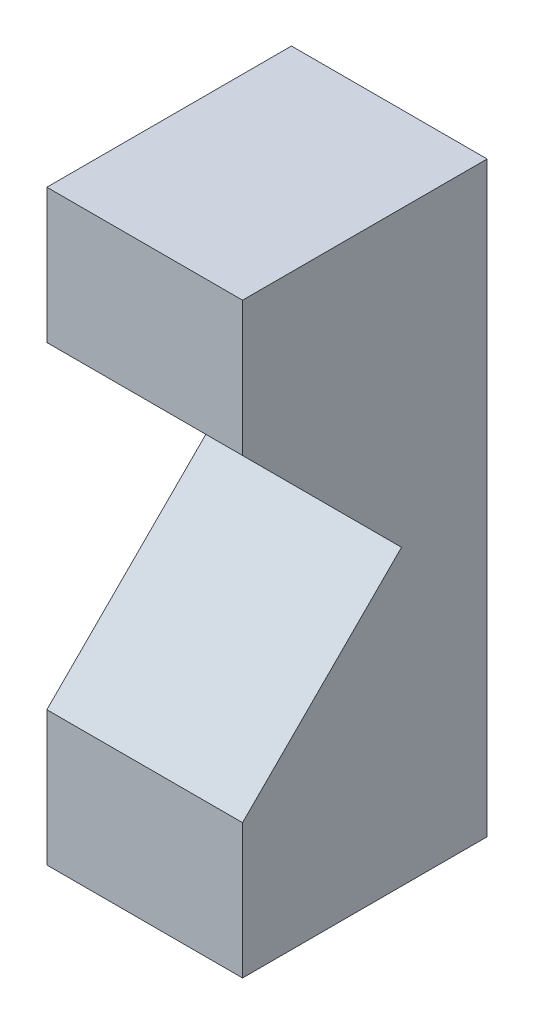
ISO-10303-21;
HEADER;
FILE_DESCRIPTION(('STEP AP214'),'2;1');
FILE_NAME('part.step','',(''),(''),'','','');
FILE_SCHEMA(('AUTOMOTIVE_DESIGN { 1 0 10303 214 1 1 1 1 }'));
ENDSEC;
DATA;
#1=APPLICATION_CONTEXT('core data for automotive mechanical design processes');
#2=APPLICATION_PROTOCOL_DEFINITION('international standard','automotive_design',2000,#1);
#3=PRODUCT_CONTEXT('',#1,'mechanical');
#4=PRODUCT('Part','Part','',(#3));
#5=PRODUCT_RELATED_PRODUCT_CATEGORY('part','',(#4));
#6=PRODUCT_DEFINITION_FORMATION('','',#4);
#7=PRODUCT_DEFINITION_CONTEXT('part definition',#1,'design');
#8=PRODUCT_DEFINITION('design','',#6,#7);
#9=PRODUCT_DEFINITION_SHAPE('','',#8);
#10=(LENGTH_UNIT() NAMED_UNIT(*) SI_UNIT(.MILLI.,.METRE.));
#11=(NAMED_UNIT(*) PLANE_ANGLE_UNIT() SI_UNIT($,.RADIAN.));
#12=(NAMED_UNIT(*) SI_UNIT($,.STERADIAN.) SOLID_ANGLE_UNIT());
#13=UNCERTAINTY_MEASURE_WITH_UNIT(LENGTH_MEASURE(1.E-05),#10,'distance_accuracy_value','');
#14=(GEOMETRIC_REPRESENTATION_CONTEXT(3) GLOBAL_UNCERTAINTY_ASSIGNED_CONTEXT((#13)) GLOBAL_UNIT_ASSIGNED_CONTEXT((#10,
#11,#12)) REPRESENTATION_CONTEXT('',''));
#15=CARTESIAN_POINT('',(0.,0.,0.));
#16=DIRECTION('',(0.,0.,1.));
#17=DIRECTION('',(1.,0.,0.));
#18=AXIS2_PLACEMENT_3D('',#15,#16,#17);
#19=CARTESIAN_POINT('',(12.7,19.05,0.));
#20=DIRECTION('',(0.,0.,-1.));
#21=DIRECTION('',(0.,1.,0.));
#22=AXIS2_PLACEMENT_3D('',#19,#20,#21);
#23=PLANE('',#22);
#24=DIRECTION('',(0.,-1.,0.));
#25=VECTOR('',#24,1.);
#26=CARTESIAN_POINT('',(0.,19.05,0.));
#27=LINE('',#26,#25);
#28=CARTESIAN_POINT('',(0.,19.05,0.));
#29=VERTEX_POINT('',#28);
#30=CARTESIAN_POINT('',(0.,10.31875,0.));
#31=VERTEX_POINT('',#30);
#32=EDGE_CURVE('E122',#29,#31,#27,.T.);
#33=ORIENTED_EDGE('',*,*,#32,.T.);
#34=DIRECTION('',(-1.,0.,0.));
#35=VECTOR('',#34,1.);
#36=CARTESIAN_POINT('',(12.7,10.31875,0.));
#37=LINE('',#36,#35);
#38=CARTESIAN_POINT('',(12.7,10.31875,0.));
#39=VERTEX_POINT('',#38);
#40=EDGE_CURVE('E11',#39,#31,#37,.T.);
#41=ORIENTED_EDGE('',*,*,#40,.F.);
#42=DIRECTION('',(0.,-1.,0.));
#43=VECTOR('',#42,1.);
#44=CARTESIAN_POINT('',(12.7,19.05,0.));
#45=LINE('',#44,#43);
#46=CARTESIAN_POINT('',(12.7,19.05,0.));
#47=VERTEX_POINT('',#46);
#48=EDGE_CURVE('E134',#47,#39,#45,.T.);
#49=ORIENTED_EDGE('',*,*,#48,.F.);
#50=DIRECTION('',(-1.,0.,0.));
#51=VECTOR('',#50,1.);
#52=CARTESIAN_POINT('',(12.7,19.05,0.));
#53=LINE('',#52,#51);
#54=EDGE_CURVE('E118',#47,#29,#53,.T.);
#55=ORIENTED_EDGE('',*,*,#54,.T.);
#56=EDGE_LOOP('',(#33,#41,#49,#55));
#57=FACE_BOUND('',#56,.T.);
#58=ADVANCED_FACE('F32',(#57),#23,.F.);
#59=CARTESIAN_POINT('',(12.7,10.31875,0.));
#60=DIRECTION('',(0.,0.707106781186548,-0.707106781186548));
#61=DIRECTION('',(0.,0.707106781186548,0.707106781186548));
#62=AXIS2_PLACEMENT_3D('',#59,#60,#61);
#63=PLANE('',#62);
#64=DIRECTION('',(0.,-0.707106781186548,-0.707106781186548));
#65=VECTOR('',#64,1.);
#66=CARTESIAN_POINT('',(0.,10.31875,0.));
#67=LINE('',#66,#65);
#68=CARTESIAN_POINT('',(0.,0.,-10.31875));
#69=VERTEX_POINT('',#68);
#70=EDGE_CURVE('E125',#31,#69,#67,.T.);
#71=ORIENTED_EDGE('',*,*,#70,.T.);
#72=DIRECTION('',(-1.,0.,0.));
#73=VECTOR('',#72,1.);
#74=CARTESIAN_POINT('',(12.7,0.,-10.31875));
#75=LINE('',#74,#73);
#76=CARTESIAN_POINT('',(12.7,0.,-10.31875));
#77=VERTEX_POINT('',#76);
#78=EDGE_CURVE('E40',#77,#69,#75,.T.);
#79=ORIENTED_EDGE('',*,*,#78,.F.);
#80=DIRECTION('',(0.,-0.707106781186548,-0.707106781186548));
#81=VECTOR('',#80,1.);
#82=CARTESIAN_POINT('',(12.7,10.31875,0.));
#83=LINE('',#82,#81);
#84=EDGE_CURVE('E88',#39,#77,#83,.T.);
#85=ORIENTED_EDGE('',*,*,#84,.F.);
#86=ORIENTED_EDGE('',*,*,#40,.T.);
#87=EDGE_LOOP('',(#71,#79,#85,#86));
#88=FACE_BOUND('',#87,.T.);
#89=ADVANCED_FACE('F159',(#88),#63,.F.);
#90=CARTESIAN_POINT('',(12.7,0.,-10.31875));
#91=DIRECTION('',(0.,-0.707106781186548,-0.707106781186548));
#92=DIRECTION('',(0.,0.707106781186548,-0.707106781186548));
#93=AXIS2_PLACEMENT_3D('',#90,#91,#92);
#94=PLANE('',#93);
#95=DIRECTION('',(0.,-0.707106781186548,0.707106781186548));
#96=VECTOR('',#95,1.);
#97=CARTESIAN_POINT('',(0.,0.,-10.31875));
#98=LINE('',#97,#96);
#99=CARTESIAN_POINT('',(0.,-10.31875,0.));
#100=VERTEX_POINT('',#99);
#101=EDGE_CURVE('E127',#69,#100,#98,.T.);
#102=ORIENTED_EDGE('',*,*,#101,.T.);
#103=DIRECTION('',(-1.,0.,0.));
#104=VECTOR('',#103,1.);
#105=CARTESIAN_POINT('',(12.7,-10.31875,0.));
#106=LINE('',#105,#104);
#107=CARTESIAN_POINT('',(12.7,-10.31875,0.));
#108=VERTEX_POINT('',#107);
#109=EDGE_CURVE('E138',#108,#100,#106,.T.);
#110=ORIENTED_EDGE('',*,*,#109,.F.);
#111=DIRECTION('',(0.,-0.707106781186548,0.707106781186548));
#112=VECTOR('',#111,1.);
#113=CARTESIAN_POINT('',(12.7,0.,-10.31875));
#114=LINE('',#113,#112);
#115=EDGE_CURVE('E146',#77,#108,#114,.T.);
#116=ORIENTED_EDGE('',*,*,#115,.F.);
#117=ORIENTED_EDGE('',*,*,#78,.T.);
#118=EDGE_LOOP('',(#102,#110,#116,#117));
#119=FACE_BOUND('',#118,.T.);
#120=ADVANCED_FACE('F144',(#119),#94,.F.);
#121=CARTESIAN_POINT('',(12.7,-10.31875,0.));
#122=DIRECTION('',(0.,0.,-1.));
#123=DIRECTION('',(0.,1.,0.));
#124=AXIS2_PLACEMENT_3D('',#121,#122,#123);
#125=PLANE('',#124);
#126=DIRECTION('',(0.,-1.,0.));
#127=VECTOR('',#126,1.);
#128=CARTESIAN_POINT('',(0.,-10.31875,0.));
#129=LINE('',#128,#127);
#130=CARTESIAN_POINT('',(0.,-19.05,0.));
#131=VERTEX_POINT('',#130);
#132=EDGE_CURVE('E129',#100,#131,#129,.T.);
#133=ORIENTED_EDGE('',*,*,#132,.T.);
#134=DIRECTION('',(-1.,0.,0.));
#135=VECTOR('',#134,1.);
#136=CARTESIAN_POINT('',(12.7,-19.05,0.));
#137=LINE('',#136,#135);
#138=CARTESIAN_POINT('',(12.7,-19.05,0.));
#139=VERTEX_POINT('',#138);
#140=EDGE_CURVE('E113',#139,#131,#137,.T.);
#141=ORIENTED_EDGE('',*,*,#140,.F.);
#142=DIRECTION('',(0.,-1.,0.));
#143=VECTOR('',#142,1.);
#144=CARTESIAN_POINT('',(12.7,-10.31875,0.));
#145=LINE('',#144,#143);
#146=EDGE_CURVE('E104',#108,#139,#145,.T.);
#147=ORIENTED_EDGE('',*,*,#146,.F.);
#148=ORIENTED_EDGE('',*,*,#109,.T.);
#149=EDGE_LOOP('',(#133,#141,#147,#148));
#150=FACE_BOUND('',#149,.T.);
#151=ADVANCED_FACE('F152',(#150),#125,.F.);
#152=CARTESIAN_POINT('',(12.7,-19.05,0.));
#153=DIRECTION('',(0.,1.,0.));
#154=DIRECTION('',(0.,0.,1.));
#155=AXIS2_PLACEMENT_3D('',#152,#153,#154);
#156=PLANE('',#155);
#157=DIRECTION('',(0.,0.,-1.));
#158=VECTOR('',#157,1.);
#159=CARTESIAN_POINT('',(0.,-19.05,0.));
#160=LINE('',#159,#158);
#161=CARTESIAN_POINT('',(0.,-19.05,-15.875));
#162=VERTEX_POINT('',#161);
#163=EDGE_CURVE('E112',#131,#162,#160,.T.);
#164=ORIENTED_EDGE('',*,*,#163,.T.);
#165=DIRECTION('',(-1.,0.,0.));
#166=VECTOR('',#165,1.);
#167=CARTESIAN_POINT('',(12.7,-19.05,-15.875));
#168=LINE('',#167,#166);
#169=CARTESIAN_POINT('',(12.7,-19.05,-15.875));
#170=VERTEX_POINT('',#169);
#171=EDGE_CURVE('E109',#170,#162,#168,.T.);
#172=ORIENTED_EDGE('',*,*,#171,.F.);
#173=DIRECTION('',(0.,0.,-1.));
#174=VECTOR('',#173,1.);
#175=CARTESIAN_POINT('',(12.7,-19.05,0.));
#176=LINE('',#175,#174);
#177=EDGE_CURVE('E98',#139,#170,#176,.T.);
#178=ORIENTED_EDGE('',*,*,#177,.F.);
#179=ORIENTED_EDGE('',*,*,#140,.T.);
#180=EDGE_LOOP('',(#164,#172,#178,#179));
#181=FACE_BOUND('',#180,.T.);
#182=ADVANCED_FACE('F110',(#181),#156,.F.);
#183=CARTESIAN_POINT('',(12.7,-19.05,-15.875));
#184=DIRECTION('',(0.,0.,1.));
#185=DIRECTION('',(1.,0.,0.));
#186=AXIS2_PLACEMENT_3D('',#183,#184,#185);
#187=PLANE('',#186);
#188=DIRECTION('',(0.,1.,0.));
#189=VECTOR('',#188,1.);
#190=CARTESIAN_POINT('',(0.,-19.05,-15.875));
#191=LINE('',#190,#189);
#192=CARTESIAN_POINT('',(0.,19.05,-15.875));
#193=VERTEX_POINT('',#192);
#194=EDGE_CURVE('E74',#162,#193,#191,.T.);
#195=ORIENTED_EDGE('',*,*,#194,.T.);
#196=DIRECTION('',(-1.,0.,0.));
#197=VECTOR('',#196,1.);
#198=CARTESIAN_POINT('',(12.7,19.05,-15.875));
#199=LINE('',#198,#197);
#200=CARTESIAN_POINT('',(12.7,19.05,-15.875));
#201=VERTEX_POINT('',#200);
#202=EDGE_CURVE('E114',#201,#193,#199,.T.);
#203=ORIENTED_EDGE('',*,*,#202,.F.);
#204=DIRECTION('',(0.,1.,0.));
#205=VECTOR('',#204,1.);
#206=CARTESIAN_POINT('',(12.7,-19.05,-15.875));
#207=LINE('',#206,#205);
#208=EDGE_CURVE('E102',#170,#201,#207,.T.);
#209=ORIENTED_EDGE('',*,*,#208,.F.);
#210=ORIENTED_EDGE('',*,*,#171,.T.);
#211=EDGE_LOOP('',(#195,#203,#209,#210));
#212=FACE_BOUND('',#211,.T.);
#213=ADVANCED_FACE('F116',(#212),#187,.F.);
#214=CARTESIAN_POINT('',(12.7,19.05,-15.875));
#215=DIRECTION('',(0.,-1.,0.));
#216=DIRECTION('',(0.,0.,-1.));
#217=AXIS2_PLACEMENT_3D('',#214,#215,#216);
#218=PLANE('',#217);
#219=DIRECTION('',(0.,0.,1.));
#220=VECTOR('',#219,1.);
#221=CARTESIAN_POINT('',(0.,19.05,-15.875));
#222=LINE('',#221,#220);
#223=EDGE_CURVE('E80',#193,#29,#222,.T.);
#224=ORIENTED_EDGE('',*,*,#223,.T.);
#225=ORIENTED_EDGE('',*,*,#54,.F.);
#226=DIRECTION('',(0.,0.,1.));
#227=VECTOR('',#226,1.);
#228=CARTESIAN_POINT('',(12.7,19.05,-15.875));
#229=LINE('',#228,#227);
#230=EDGE_CURVE('E48',#201,#47,#229,.T.);
#231=ORIENTED_EDGE('',*,*,#230,.F.);
#232=ORIENTED_EDGE('',*,*,#202,.T.);
#233=EDGE_LOOP('',(#224,#225,#231,#232));
#234=FACE_BOUND('',#233,.T.);
#235=ADVANCED_FACE('F173',(#234),#218,.F.);
#236=CARTESIAN_POINT('',(12.7,0.,0.));
#237=DIRECTION('',(1.,0.,0.));
#238=DIRECTION('',(0.,0.,-1.));
#239=AXIS2_PLACEMENT_3D('',#236,#237,#238);
#240=PLANE('',#239);
#241=ORIENTED_EDGE('',*,*,#48,.T.);
#242=ORIENTED_EDGE('',*,*,#84,.T.);
#243=ORIENTED_EDGE('',*,*,#115,.T.);
#244=ORIENTED_EDGE('',*,*,#146,.T.);
#245=ORIENTED_EDGE('',*,*,#177,.T.);
#246=ORIENTED_EDGE('',*,*,#208,.T.);
#247=ORIENTED_EDGE('',*,*,#230,.T.);
#248=EDGE_LOOP('',(#241,#242,#243,#244,#245,#246,#247));
#249=FACE_BOUND('',#248,.T.);
#250=ADVANCED_FACE('F100',(#249),#240,.T.);
#251=CARTESIAN_POINT('',(0.,0.,0.));
#252=DIRECTION('',(1.,0.,0.));
#253=DIRECTION('',(0.,0.,-1.));
#254=AXIS2_PLACEMENT_3D('',#251,#252,#253);
#255=PLANE('',#254);
#256=ORIENTED_EDGE('',*,*,#32,.F.);
#257=ORIENTED_EDGE('',*,*,#223,.F.);
#258=ORIENTED_EDGE('',*,*,#194,.F.);
#259=ORIENTED_EDGE('',*,*,#163,.F.);
#260=ORIENTED_EDGE('',*,*,#132,.F.);
#261=ORIENTED_EDGE('',*,*,#101,.F.);
#262=ORIENTED_EDGE('',*,*,#70,.F.);
#263=EDGE_LOOP('',(#256,#257,#258,#259,#260,#261,#262));
#264=FACE_BOUND('',#263,.T.);
#265=ADVANCED_FACE('F150',(#264),#255,.F.);
#266=CLOSED_SHELL('',(#58,#89,#120,#151,#182,#213,#235,#250,#265));
#267=MANIFOLD_SOLID_BREP('B2',#266);
#268=ADVANCED_BREP_SHAPE_REPRESENTATION('',(#18,#267),#14);
#269=SHAPE_DEFINITION_REPRESENTATION(#9,#268);
ENDSEC;
END-ISO-10303-21;
